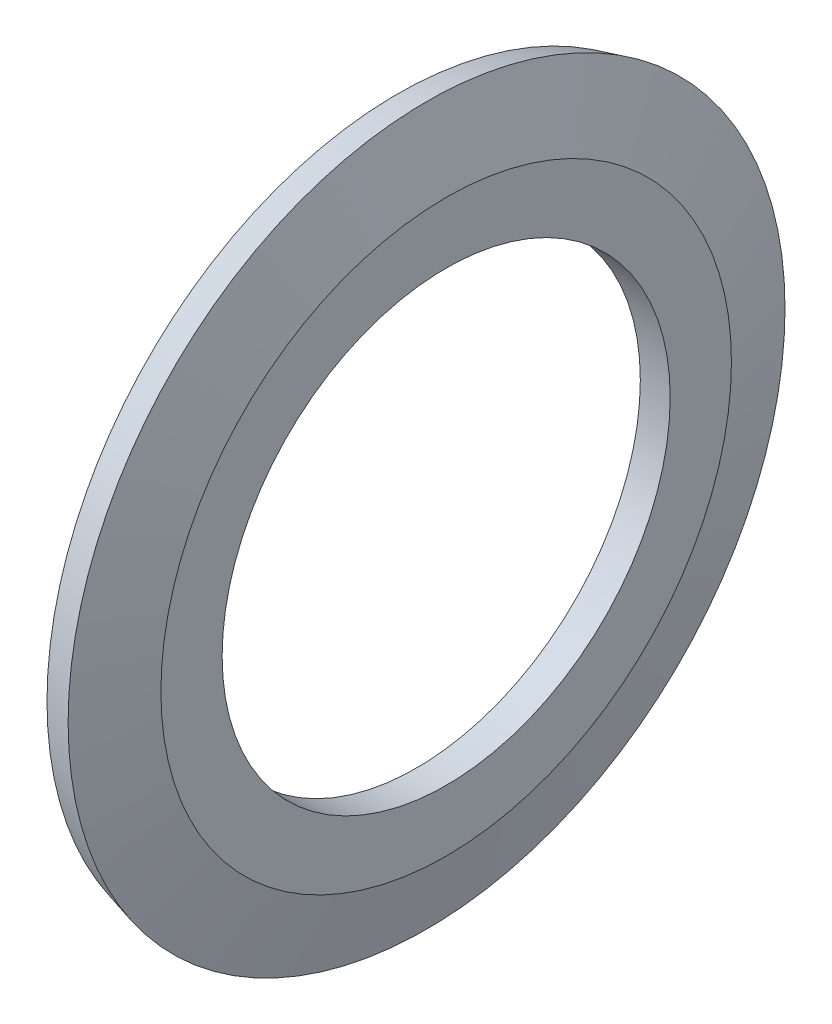
ISO-10303-21;
HEADER;
FILE_DESCRIPTION(('STEP AP214'),'2;1');
FILE_NAME('part.step','',(''),(''),'','','');
FILE_SCHEMA(('AUTOMOTIVE_DESIGN { 1 0 10303 214 1 1 1 1 }'));
ENDSEC;
DATA;
#1=APPLICATION_CONTEXT('core data for automotive mechanical design processes');
#2=APPLICATION_PROTOCOL_DEFINITION('international standard','automotive_design',2000,#1);
#3=PRODUCT_CONTEXT('',#1,'mechanical');
#4=PRODUCT('Part','Part','',(#3));
#5=PRODUCT_RELATED_PRODUCT_CATEGORY('part','',(#4));
#6=PRODUCT_DEFINITION_FORMATION('','',#4);
#7=PRODUCT_DEFINITION_CONTEXT('part definition',#1,'design');
#8=PRODUCT_DEFINITION('design','',#6,#7);
#9=PRODUCT_DEFINITION_SHAPE('','',#8);
#10=(LENGTH_UNIT() NAMED_UNIT(*) SI_UNIT(.MILLI.,.METRE.));
#11=(NAMED_UNIT(*) PLANE_ANGLE_UNIT() SI_UNIT($,.RADIAN.));
#12=(NAMED_UNIT(*) SI_UNIT($,.STERADIAN.) SOLID_ANGLE_UNIT());
#13=UNCERTAINTY_MEASURE_WITH_UNIT(LENGTH_MEASURE(1.E-05),#10,'distance_accuracy_value','');
#14=(GEOMETRIC_REPRESENTATION_CONTEXT(3) GLOBAL_UNCERTAINTY_ASSIGNED_CONTEXT((#13)) GLOBAL_UNIT_ASSIGNED_CONTEXT((#10,
#11,#12)) REPRESENTATION_CONTEXT('',''));
#15=CARTESIAN_POINT('',(0.,0.,0.));
#16=DIRECTION('',(0.,0.,1.));
#17=DIRECTION('',(1.,0.,0.));
#18=AXIS2_PLACEMENT_3D('',#15,#16,#17);
#19=CARTESIAN_POINT('',(0.,0.,0.));
#20=DIRECTION('',(-1.,0.,0.));
#21=DIRECTION('',(0.,0.,1.));
#22=AXIS2_PLACEMENT_3D('',#19,#20,#21);
#23=CYLINDRICAL_SURFACE('',#22,7.5);
#24=CARTESIAN_POINT('',(0.999999999999999,0.,0.));
#25=DIRECTION('',(-1.,0.,0.));
#26=DIRECTION('',(0.,0.,1.));
#27=AXIS2_PLACEMENT_3D('',#24,#25,#26);
#28=CIRCLE('',#27,7.5);
#29=CARTESIAN_POINT('',(0.999999999999999,0.,7.5));
#30=VERTEX_POINT('',#29);
#31=EDGE_CURVE('E10',#30,#30,#28,.T.);
#32=ORIENTED_EDGE('',*,*,#31,.F.);
#33=EDGE_LOOP('',(#32));
#34=FACE_BOUND('',#33,.T.);
#35=CARTESIAN_POINT('',(0.,0.,0.));
#36=DIRECTION('',(-1.,0.,0.));
#37=DIRECTION('',(0.,0.,1.));
#38=AXIS2_PLACEMENT_3D('',#35,#36,#37);
#39=CIRCLE('',#38,7.5);
#40=CARTESIAN_POINT('',(0.,0.,7.5));
#41=VERTEX_POINT('',#40);
#42=EDGE_CURVE('E62',#41,#41,#39,.T.);
#43=ORIENTED_EDGE('',*,*,#42,.T.);
#44=EDGE_LOOP('',(#43));
#45=FACE_BOUND('',#44,.T.);
#46=ADVANCED_FACE('F34',(#34,#45),#23,.F.);
#47=CARTESIAN_POINT('',(0.999999999999997,7.5,0.));
#48=DIRECTION('',(-1.,0.,0.));
#49=DIRECTION('',(0.,0.,1.));
#50=AXIS2_PLACEMENT_3D('',#47,#48,#49);
#51=PLANE('',#50);
#52=CARTESIAN_POINT('',(0.999999999999995,0.,0.));
#53=DIRECTION('',(-1.,0.,0.));
#54=DIRECTION('',(0.,0.,1.));
#55=AXIS2_PLACEMENT_3D('',#52,#53,#54);
#56=CIRCLE('',#55,9.55);
#57=CARTESIAN_POINT('',(0.999999999999995,0.,9.55));
#58=VERTEX_POINT('',#57);
#59=EDGE_CURVE('E41',#58,#58,#56,.T.);
#60=ORIENTED_EDGE('',*,*,#59,.F.);
#61=EDGE_LOOP('',(#60));
#62=FACE_BOUND('',#61,.T.);
#63=ORIENTED_EDGE('',*,*,#31,.T.);
#64=EDGE_LOOP('',(#63));
#65=FACE_BOUND('',#64,.T.);
#66=ADVANCED_FACE('F87',(#62,#65),#51,.F.);
#67=CARTESIAN_POINT('',(0.999999999999995,0.,0.));
#68=DIRECTION('',(-1.,0.,0.));
#69=DIRECTION('',(0.,0.,1.));
#70=AXIS2_PLACEMENT_3D('',#67,#68,#69);
#71=CONICAL_SURFACE('',#70,9.55,1.30899693899575);
#72=CARTESIAN_POINT('',(0.343524478543742,0.,0.));
#73=DIRECTION('',(-1.,0.,0.));
#74=DIRECTION('',(0.,0.,1.));
#75=AXIS2_PLACEMENT_3D('',#72,#73,#74);
#76=CIRCLE('',#75,12.);
#77=CARTESIAN_POINT('',(0.343524478543742,0.,12.));
#78=VERTEX_POINT('',#77);
#79=EDGE_CURVE('E47',#78,#78,#76,.T.);
#80=ORIENTED_EDGE('',*,*,#79,.F.);
#81=EDGE_LOOP('',(#80));
#82=FACE_BOUND('',#81,.T.);
#83=ORIENTED_EDGE('',*,*,#59,.T.);
#84=EDGE_LOOP('',(#83));
#85=FACE_BOUND('',#84,.T.);
#86=ADVANCED_FACE('F82',(#82,#85),#71,.T.);
#87=CARTESIAN_POINT('',(0.343524478543742,0.,0.));
#88=DIRECTION('',(1.,0.,0.));
#89=DIRECTION('',(0.,0.,-1.));
#90=AXIS2_PLACEMENT_3D('',#87,#88,#89);
#91=CONICAL_SURFACE('',#90,12.,0.261799387799153);
#92=CARTESIAN_POINT('',(-0.622401347745326,0.,0.));
#93=DIRECTION('',(-1.,0.,0.));
#94=DIRECTION('',(0.,0.,1.));
#95=AXIS2_PLACEMENT_3D('',#92,#93,#94);
#96=CIRCLE('',#95,11.7411809548975);
#97=CARTESIAN_POINT('',(-0.622401347745326,0.,11.7411809548975));
#98=VERTEX_POINT('',#97);
#99=EDGE_CURVE('E53',#98,#98,#96,.T.);
#100=ORIENTED_EDGE('',*,*,#99,.F.);
#101=EDGE_LOOP('',(#100));
#102=FACE_BOUND('',#101,.T.);
#103=ORIENTED_EDGE('',*,*,#79,.T.);
#104=EDGE_LOOP('',(#103));
#105=FACE_BOUND('',#104,.T.);
#106=ADVANCED_FACE('F76',(#102,#105),#91,.T.);
#107=CARTESIAN_POINT('',(-0.622401347745326,0.,0.));
#108=DIRECTION('',(-1.,0.,0.));
#109=DIRECTION('',(0.,0.,1.));
#110=AXIS2_PLACEMENT_3D('',#107,#108,#109);
#111=CONICAL_SURFACE('',#110,11.7411809548975,1.30899693899575);
#112=CARTESIAN_POINT('',(0.,0.,0.));
#113=DIRECTION('',(-1.,0.,0.));
#114=DIRECTION('',(0.,0.,1.));
#115=AXIS2_PLACEMENT_3D('',#112,#113,#114);
#116=CIRCLE('',#115,9.41834750241259);
#117=CARTESIAN_POINT('',(0.,0.,9.41834750241259));
#118=VERTEX_POINT('',#117);
#119=EDGE_CURVE('E59',#118,#118,#116,.T.);
#120=ORIENTED_EDGE('',*,*,#119,.F.);
#121=EDGE_LOOP('',(#120));
#122=FACE_BOUND('',#121,.T.);
#123=ORIENTED_EDGE('',*,*,#99,.T.);
#124=EDGE_LOOP('',(#123));
#125=FACE_BOUND('',#124,.T.);
#126=ADVANCED_FACE('F70',(#122,#125),#111,.F.);
#127=CARTESIAN_POINT('',(0.,7.5,0.));
#128=DIRECTION('',(1.,0.,0.));
#129=DIRECTION('',(0.,0.,-1.));
#130=AXIS2_PLACEMENT_3D('',#127,#128,#129);
#131=PLANE('',#130);
#132=ORIENTED_EDGE('',*,*,#42,.F.);
#133=EDGE_LOOP('',(#132));
#134=FACE_BOUND('',#133,.T.);
#135=ORIENTED_EDGE('',*,*,#119,.T.);
#136=EDGE_LOOP('',(#135));
#137=FACE_BOUND('',#136,.T.);
#138=ADVANCED_FACE('F67',(#134,#137),#131,.F.);
#139=CLOSED_SHELL('',(#46,#66,#86,#106,#126,#138));
#140=MANIFOLD_SOLID_BREP('B2',#139);
#141=ADVANCED_BREP_SHAPE_REPRESENTATION('',(#18,#140),#14);
#142=SHAPE_DEFINITION_REPRESENTATION(#9,#141);
ENDSEC;
END-ISO-10303-21;
